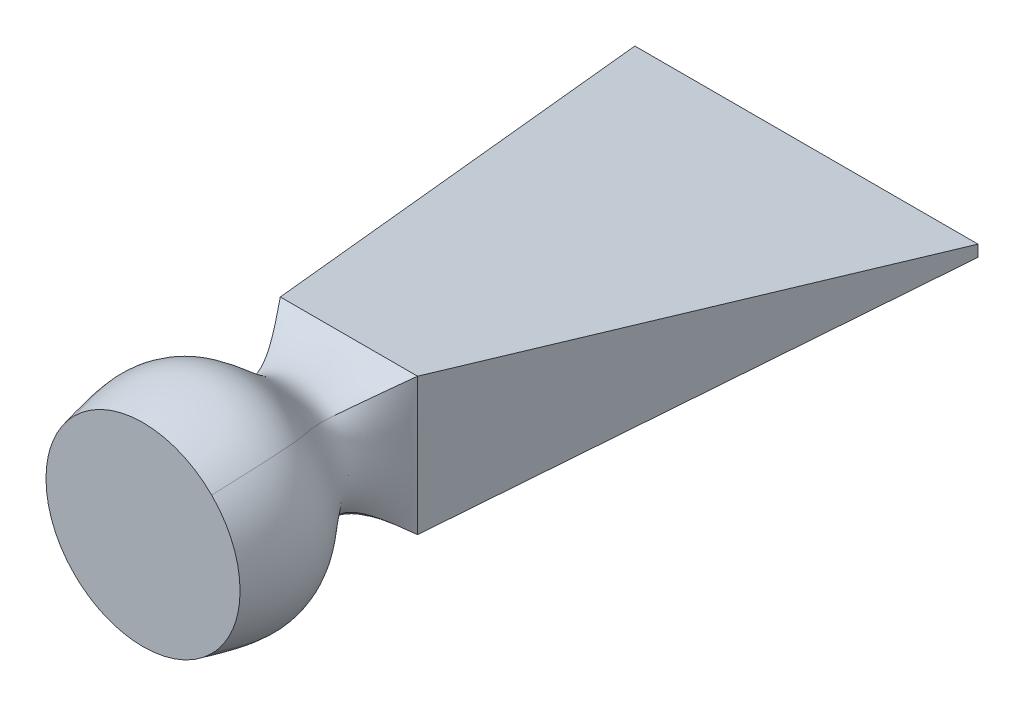
ISO-10303-21;
HEADER;
FILE_DESCRIPTION(('STEP AP214'),'2;1');
FILE_NAME('part.step','',(''),(''),'','','');
FILE_SCHEMA(('AUTOMOTIVE_DESIGN { 1 0 10303 214 1 1 1 1 }'));
ENDSEC;
DATA;
#1=APPLICATION_CONTEXT('core data for automotive mechanical design processes');
#2=APPLICATION_PROTOCOL_DEFINITION('international standard','automotive_design',2000,#1);
#3=PRODUCT_CONTEXT('',#1,'mechanical');
#4=PRODUCT('Part','Part','',(#3));
#5=PRODUCT_RELATED_PRODUCT_CATEGORY('part','',(#4));
#6=PRODUCT_DEFINITION_FORMATION('','',#4);
#7=PRODUCT_DEFINITION_CONTEXT('part definition',#1,'design');
#8=PRODUCT_DEFINITION('design','',#6,#7);
#9=PRODUCT_DEFINITION_SHAPE('','',#8);
#10=(LENGTH_UNIT() NAMED_UNIT(*) SI_UNIT(.MILLI.,.METRE.));
#11=(NAMED_UNIT(*) PLANE_ANGLE_UNIT() SI_UNIT($,.RADIAN.));
#12=(NAMED_UNIT(*) SI_UNIT($,.STERADIAN.) SOLID_ANGLE_UNIT());
#13=UNCERTAINTY_MEASURE_WITH_UNIT(LENGTH_MEASURE(1.E-05),#10,'distance_accuracy_value','');
#14=(GEOMETRIC_REPRESENTATION_CONTEXT(3) GLOBAL_UNCERTAINTY_ASSIGNED_CONTEXT((#13)) GLOBAL_UNIT_ASSIGNED_CONTEXT((#10,
#11,#12)) REPRESENTATION_CONTEXT('',''));
#15=CARTESIAN_POINT('',(0.,0.,0.));
#16=DIRECTION('',(0.,0.,1.));
#17=DIRECTION('',(1.,0.,0.));
#18=AXIS2_PLACEMENT_3D('',#15,#16,#17);
#19=CARTESIAN_POINT('',(0.,0.,90.));
#20=DIRECTION('',(0.,0.,1.));
#21=DIRECTION('',(1.,0.,0.));
#22=AXIS2_PLACEMENT_3D('',#19,#20,#21);
#23=PLANE('',#22);
#24=CARTESIAN_POINT('',(0.,0.,90.));
#25=DIRECTION('',(0.,0.,-1.));
#26=DIRECTION('',(1.,0.,0.));
#27=AXIS2_PLACEMENT_3D('',#24,#25,#26);
#28=CIRCLE('',#27,42.4264068711928);
#29=CARTESIAN_POINT('',(-30.,30.,90.));
#30=VERTEX_POINT('',#29);
#31=CARTESIAN_POINT('',(30.,30.,90.));
#32=VERTEX_POINT('',#31);
#33=EDGE_CURVE('E126',#30,#32,#28,.T.);
#34=ORIENTED_EDGE('',*,*,#33,.F.);
#35=CARTESIAN_POINT('',(-30.,-30.,90.));
#36=CARTESIAN_POINT('',(-46.557450297693,-13.442549702307,90.));
#37=CARTESIAN_POINT('',(-46.557450297693,13.442549702307,90.));
#38=CARTESIAN_POINT('',(-30.,30.,90.));
#39=B_SPLINE_CURVE_WITH_KNOTS('',3,(#35,#36,#37,#38),.UNSPECIFIED.,.F.,.F.,(4,4),(0.,1.),.UNSPECIFIED.);
#40=CARTESIAN_POINT('',(-30.,-30.,90.));
#41=VERTEX_POINT('',#40);
#42=EDGE_CURVE('E83',#41,#30,#39,.T.);
#43=ORIENTED_EDGE('',*,*,#42,.F.);
#44=CARTESIAN_POINT('',(30.,-30.,90.));
#45=CARTESIAN_POINT('',(13.442549702307,-46.557450297693,90.));
#46=CARTESIAN_POINT('',(-13.442549702307,-46.557450297693,90.));
#47=CARTESIAN_POINT('',(-30.,-30.,90.));
#48=B_SPLINE_CURVE_WITH_KNOTS('',3,(#44,#45,#46,#47),.UNSPECIFIED.,.F.,.F.,(4,4),(0.,1.),.UNSPECIFIED.);
#49=CARTESIAN_POINT('',(30.,-30.,90.));
#50=VERTEX_POINT('',#49);
#51=EDGE_CURVE('E72',#50,#41,#48,.T.);
#52=ORIENTED_EDGE('',*,*,#51,.F.);
#53=CARTESIAN_POINT('',(30.,30.,90.));
#54=CARTESIAN_POINT('',(46.557450297693,13.442549702307,90.));
#55=CARTESIAN_POINT('',(46.557450297693,-13.442549702307,90.));
#56=CARTESIAN_POINT('',(30.,-30.,90.));
#57=B_SPLINE_CURVE_WITH_KNOTS('',3,(#53,#54,#55,#56),.UNSPECIFIED.,.F.,.F.,(4,4),(0.,1.),.UNSPECIFIED.);
#58=EDGE_CURVE('E14',#32,#50,#57,.T.);
#59=ORIENTED_EDGE('',*,*,#58,.F.);
#60=EDGE_LOOP('',(#34,#43,#52,#59));
#61=FACE_BOUND('',#60,.T.);
#62=ADVANCED_FACE('F49',(#61),#23,.T.);
#63=CARTESIAN_POINT('',(-30.,-30.,90.));
#64=CARTESIAN_POINT('',(-32.1746109172198,-32.8272915726261,75.8698753625472));
#65=CARTESIAN_POINT('',(-36.0079546999678,-37.8111627038345,50.9616837409921));
#66=CARTESIAN_POINT('',(-8.05613485580845,-12.6956326424046,26.5121664833694));
#67=CARTESIAN_POINT('',(-22.8877493135882,-24.391462132661,8.59288794524507));
#68=CARTESIAN_POINT('',(-30.,-30.,0.));
#69=CARTESIAN_POINT('',(-46.557450297693,-13.442549702307,90.));
#70=CARTESIAN_POINT('',(-49.6782204145392,-14.9419255911291,75.8698753625472));
#71=CARTESIAN_POINT('',(-55.1794273799181,-17.584983802557,50.9616837409921));
#72=CARTESIAN_POINT('',(-19.8606450247527,-9.246826038816,26.5121664833694));
#73=CARTESIAN_POINT('',(-26.7137223133381,-9.75588794466155,8.59288794524507));
#74=CARTESIAN_POINT('',(-30.,-10.,0.));
#75=CARTESIAN_POINT('',(-46.557450297693,13.442549702307,90.));
#76=CARTESIAN_POINT('',(-49.9706768195403,13.9290206853176,75.8698753625472));
#77=CARTESIAN_POINT('',(-55.9874178204373,14.7865582353428,50.9616837409921));
#78=CARTESIAN_POINT('',(-21.9395343444214,2.04671978529237,26.5121664833694));
#79=CARTESIAN_POINT('',(-27.3875134569508,7.42225345012876,8.59288794524507));
#80=CARTESIAN_POINT('',(-30.,10.,0.));
#81=CARTESIAN_POINT('',(-30.,30.,90.));
#82=CARTESIAN_POINT('',(-32.8272915726261,32.1746109172198,75.8698753625472));
#83=CARTESIAN_POINT('',(-37.8111627038345,36.0079546999678,50.9616837409921));
#84=CARTESIAN_POINT('',(-12.6956326424046,8.05613485580843,26.5121664833694));
#85=CARTESIAN_POINT('',(-24.391462132661,22.8877493135882,8.59288794524507));
#86=CARTESIAN_POINT('',(-30.,30.,0.));
#87=B_SPLINE_SURFACE_WITH_KNOTS('',3,3,((#63,#64,#65,#66,#67,#68),(#69,#70,#71,#72,#73,#74),
(#75,#76,#77,#78,#79,#80),(#81,#82,#83,#84,#85,#86)),.UNSPECIFIED.,.F.,.F.,.F.,(4,4),(4,1,1,4),
(0.,1.),(0.,0.405588369270386,0.714959922892933,1.),.UNSPECIFIED.);
#88=CARTESIAN_POINT('',(-30.,30.,90.));
#89=CARTESIAN_POINT('',(-32.8272915726261,32.1746109172198,75.8698753625472));
#90=CARTESIAN_POINT('',(-37.8111627038345,36.0079546999678,50.9616837409921));
#91=CARTESIAN_POINT('',(-12.6956326424046,8.05613485580843,26.5121664833694));
#92=CARTESIAN_POINT('',(-24.391462132661,22.8877493135882,8.59288794524507));
#93=CARTESIAN_POINT('',(-30.,30.,0.));
#94=B_SPLINE_CURVE_WITH_KNOTS('',3,(#88,#89,#90,#91,#92,#93),.UNSPECIFIED.,.F.,.F.,(4,1,1,4),
(0.,0.405588369270386,0.714959922892933,1.),.UNSPECIFIED.);
#95=CARTESIAN_POINT('',(-30.,30.,0.));
#96=VERTEX_POINT('',#95);
#97=EDGE_CURVE('E56',#30,#96,#94,.T.);
#98=DIRECTION('',(0.,-1.,0.));
#99=VECTOR('',#98,1.);
#100=CARTESIAN_POINT('',(-30.,0.,0.));
#101=LINE('',#100,#99);
#102=CARTESIAN_POINT('',(-30.,-30.,0.));
#103=VERTEX_POINT('',#102);
#104=EDGE_CURVE('E108',#96,#103,#101,.T.);
#105=CARTESIAN_POINT('',(-30.,-30.,90.));
#106=CARTESIAN_POINT('',(-32.1746109172198,-32.8272915726261,75.8698753625472));
#107=CARTESIAN_POINT('',(-36.0079546999678,-37.8111627038345,50.9616837409921));
#108=CARTESIAN_POINT('',(-8.05613485580845,-12.6956326424046,26.5121664833694));
#109=CARTESIAN_POINT('',(-22.8877493135882,-24.391462132661,8.59288794524507));
#110=CARTESIAN_POINT('',(-30.,-30.,0.));
#111=B_SPLINE_CURVE_WITH_KNOTS('',3,(#105,#106,#107,#108,#109,#110),.UNSPECIFIED.,.F.,.F.,(4,1,
1,4),(0.,0.405588369270386,0.714959922892933,1.),.UNSPECIFIED.);
#112=EDGE_CURVE('E172',#41,#103,#111,.T.);
#113=ORIENTED_EDGE('',*,*,#42,.T.);
#114=ORIENTED_EDGE('',*,*,#97,.T.);
#115=ORIENTED_EDGE('',*,*,#104,.T.);
#116=ORIENTED_EDGE('',*,*,#112,.F.);
#117=EDGE_LOOP('',(#113,#114,#115,#116));
#118=FACE_BOUND('',#117,.T.);
#119=ADVANCED_FACE('F129',(#118),#87,.T.);
#120=CARTESIAN_POINT('',(-30.,30.,90.));
#121=CARTESIAN_POINT('',(-32.8272915726261,32.1746109172198,75.8698753625472));
#122=CARTESIAN_POINT('',(-37.8111627038345,36.0079546999678,50.9616837409921));
#123=CARTESIAN_POINT('',(-12.6956326424046,8.05613485580842,26.5121664833694));
#124=CARTESIAN_POINT('',(-24.391462132661,22.8877493135882,8.59288794524507));
#125=CARTESIAN_POINT('',(-30.,30.,0.));
#126=CARTESIAN_POINT('',(-13.4425497023069,46.557450297693,90.));
#127=CARTESIAN_POINT('',(-14.9419255911291,49.6782204145392,75.8698753625472));
#128=CARTESIAN_POINT('',(-17.5849838025571,55.1794273799181,50.9616837409921));
#129=CARTESIAN_POINT('',(-9.24682603881604,19.8606450247526,26.5121664833694));
#130=CARTESIAN_POINT('',(-9.75588794466156,26.7137223133381,8.59288794524507));
#131=CARTESIAN_POINT('',(-10.,30.,0.));
#132=CARTESIAN_POINT('',(13.442549702307,46.557450297693,90.));
#133=CARTESIAN_POINT('',(13.9290206853175,49.9706768195403,75.8698753625472));
#134=CARTESIAN_POINT('',(14.7865582353427,55.9874178204373,50.9616837409921));
#135=CARTESIAN_POINT('',(2.04671978529227,21.9395343444214,26.5121664833694));
#136=CARTESIAN_POINT('',(7.42225345012873,27.3875134569508,8.59288794524507));
#137=CARTESIAN_POINT('',(10.,30.,0.));
#138=CARTESIAN_POINT('',(30.,30.,90.));
#139=CARTESIAN_POINT('',(32.1746109172197,32.8272915726261,75.8698753625472));
#140=CARTESIAN_POINT('',(36.0079546999677,37.8111627038346,50.9616837409921));
#141=CARTESIAN_POINT('',(8.05613485580836,12.6956326424047,26.5121664833694));
#142=CARTESIAN_POINT('',(22.8877493135882,24.391462132661,8.59288794524507));
#143=CARTESIAN_POINT('',(30.,30.,0.));
#144=B_SPLINE_SURFACE_WITH_KNOTS('',3,3,((#120,#121,#122,#123,#124,#125),(#126,#127,#128,#129,
#130,#131),(#132,#133,#134,#135,#136,#137),(#138,#139,#140,#141,#142,#143)),.UNSPECIFIED.,.F.,
.F.,.F.,(4,4),(4,1,1,4),(0.,1.),(0.,0.405588369270386,0.714959922892933,1.),.UNSPECIFIED.);
#145=CARTESIAN_POINT('',(30.,30.,90.));
#146=CARTESIAN_POINT('',(32.1746109172197,32.8272915726261,75.8698753625472));
#147=CARTESIAN_POINT('',(36.0079546999678,37.8111627038346,50.9616837409921));
#148=CARTESIAN_POINT('',(8.05613485580837,12.6956326424047,26.5121664833694));
#149=CARTESIAN_POINT('',(22.8877493135882,24.391462132661,8.59288794524507));
#150=CARTESIAN_POINT('',(30.,30.,0.));
#151=B_SPLINE_CURVE_WITH_KNOTS('',3,(#145,#146,#147,#148,#149,#150),.UNSPECIFIED.,.F.,.F.,(4,1,
1,4),(0.,0.405588369270386,0.714959922892933,1.),.UNSPECIFIED.);
#152=CARTESIAN_POINT('',(30.,30.,0.));
#153=VERTEX_POINT('',#152);
#154=EDGE_CURVE('E124',#153,#32,#151,.F.);
#155=DIRECTION('',(-1.,0.,0.));
#156=VECTOR('',#155,1.);
#157=CARTESIAN_POINT('',(0.,30.,0.));
#158=LINE('',#157,#156);
#159=EDGE_CURVE('E96',#153,#96,#158,.T.);
#160=ORIENTED_EDGE('',*,*,#33,.T.);
#161=ORIENTED_EDGE('',*,*,#154,.F.);
#162=ORIENTED_EDGE('',*,*,#159,.T.);
#163=ORIENTED_EDGE('',*,*,#97,.F.);
#164=EDGE_LOOP('',(#160,#161,#162,#163));
#165=FACE_BOUND('',#164,.T.);
#166=ADVANCED_FACE('F121',(#165),#144,.T.);
#167=CARTESIAN_POINT('',(30.,-30.,90.));
#168=CARTESIAN_POINT('',(32.8272915726261,-32.1746109172197,75.8698753625472));
#169=CARTESIAN_POINT('',(37.8111627038345,-36.0079546999678,50.9616837409921));
#170=CARTESIAN_POINT('',(12.6956326424046,-8.05613485580846,26.5121664833694));
#171=CARTESIAN_POINT('',(24.391462132661,-22.8877493135882,8.59288794524507));
#172=CARTESIAN_POINT('',(30.,-30.,0.));
#173=CARTESIAN_POINT('',(13.442549702307,-46.557450297693,90.));
#174=CARTESIAN_POINT('',(14.9419255911291,-49.6782204145392,75.8698753625472));
#175=CARTESIAN_POINT('',(17.5849838025571,-55.1794273799181,50.9616837409921));
#176=CARTESIAN_POINT('',(9.24682603881599,-19.8606450247527,26.5121664833694));
#177=CARTESIAN_POINT('',(9.75588794466155,-26.7137223133381,8.59288794524507));
#178=CARTESIAN_POINT('',(10.,-30.,0.));
#179=CARTESIAN_POINT('',(-13.442549702307,-46.557450297693,90.));
#180=CARTESIAN_POINT('',(-13.9290206853176,-49.9706768195403,75.8698753625472));
#181=CARTESIAN_POINT('',(-14.7865582353429,-55.9874178204373,50.9616837409921));
#182=CARTESIAN_POINT('',(-2.0467197852924,-21.9395343444214,26.5121664833694));
#183=CARTESIAN_POINT('',(-7.42225345012877,-27.3875134569508,8.59288794524507));
#184=CARTESIAN_POINT('',(-9.99999999999999,-30.,0.));
#185=CARTESIAN_POINT('',(-30.,-30.,90.));
#186=CARTESIAN_POINT('',(-32.1746109172198,-32.8272915726261,75.8698753625472));
#187=CARTESIAN_POINT('',(-36.0079546999678,-37.8111627038345,50.9616837409921));
#188=CARTESIAN_POINT('',(-8.05613485580845,-12.6956326424046,26.5121664833694));
#189=CARTESIAN_POINT('',(-22.8877493135882,-24.391462132661,8.59288794524507));
#190=CARTESIAN_POINT('',(-30.,-30.,0.));
#191=B_SPLINE_SURFACE_WITH_KNOTS('',3,3,((#167,#168,#169,#170,#171,#172),(#173,#174,#175,#176,
#177,#178),(#179,#180,#181,#182,#183,#184),(#185,#186,#187,#188,#189,#190)),.UNSPECIFIED.,.F.,
.F.,.F.,(4,4),(4,1,1,4),(0.,1.),(0.,0.405588369270386,0.714959922892933,1.),.UNSPECIFIED.);
#192=DIRECTION('',(1.,0.,0.));
#193=VECTOR('',#192,1.);
#194=CARTESIAN_POINT('',(0.,-30.,0.));
#195=LINE('',#194,#193);
#196=CARTESIAN_POINT('',(30.,-30.,0.));
#197=VERTEX_POINT('',#196);
#198=EDGE_CURVE('E218',#103,#197,#195,.T.);
#199=CARTESIAN_POINT('',(30.,-30.,90.));
#200=CARTESIAN_POINT('',(32.8272915726261,-32.1746109172197,75.8698753625472));
#201=CARTESIAN_POINT('',(37.8111627038345,-36.0079546999678,50.9616837409921));
#202=CARTESIAN_POINT('',(12.6956326424046,-8.05613485580846,26.5121664833694));
#203=CARTESIAN_POINT('',(24.391462132661,-22.8877493135882,8.59288794524507));
#204=CARTESIAN_POINT('',(30.,-30.,0.));
#205=B_SPLINE_CURVE_WITH_KNOTS('',3,(#199,#200,#201,#202,#203,#204),.UNSPECIFIED.,.F.,.F.,(4,1,
1,4),(0.,0.405588369270386,0.714959922892933,1.),.UNSPECIFIED.);
#206=EDGE_CURVE('E63',#50,#197,#205,.T.);
#207=ORIENTED_EDGE('',*,*,#51,.T.);
#208=ORIENTED_EDGE('',*,*,#112,.T.);
#209=ORIENTED_EDGE('',*,*,#198,.T.);
#210=ORIENTED_EDGE('',*,*,#206,.F.);
#211=EDGE_LOOP('',(#207,#208,#209,#210));
#212=FACE_BOUND('',#211,.T.);
#213=ADVANCED_FACE('F177',(#212),#191,.T.);
#214=CARTESIAN_POINT('',(30.,30.,90.));
#215=CARTESIAN_POINT('',(32.1746109172197,32.8272915726261,75.8698753625472));
#216=CARTESIAN_POINT('',(36.0079546999678,37.8111627038346,50.9616837409921));
#217=CARTESIAN_POINT('',(8.05613485580837,12.6956326424047,26.5121664833694));
#218=CARTESIAN_POINT('',(22.8877493135882,24.391462132661,8.59288794524507));
#219=CARTESIAN_POINT('',(30.,30.,0.));
#220=CARTESIAN_POINT('',(46.557450297693,13.442549702307,90.));
#221=CARTESIAN_POINT('',(49.6782204145392,14.9419255911291,75.8698753625472));
#222=CARTESIAN_POINT('',(55.1794273799181,17.5849838025571,50.9616837409921));
#223=CARTESIAN_POINT('',(19.8606450247526,9.24682603881611,26.5121664833694));
#224=CARTESIAN_POINT('',(26.713722313338,9.75588794466159,8.59288794524507));
#225=CARTESIAN_POINT('',(30.,10.,0.));
#226=CARTESIAN_POINT('',(46.557450297693,-13.442549702307,90.));
#227=CARTESIAN_POINT('',(49.9706768195403,-13.9290206853176,75.8698753625472));
#228=CARTESIAN_POINT('',(55.9874178204373,-14.7865582353428,50.9616837409921));
#229=CARTESIAN_POINT('',(21.9395343444214,-2.04671978529241,26.5121664833694));
#230=CARTESIAN_POINT('',(27.3875134569508,-7.42225345012877,8.59288794524507));
#231=CARTESIAN_POINT('',(30.,-10.,0.));
#232=CARTESIAN_POINT('',(30.,-30.,90.));
#233=CARTESIAN_POINT('',(32.8272915726261,-32.1746109172197,75.8698753625472));
#234=CARTESIAN_POINT('',(37.8111627038345,-36.0079546999678,50.9616837409921));
#235=CARTESIAN_POINT('',(12.6956326424046,-8.05613485580846,26.5121664833694));
#236=CARTESIAN_POINT('',(24.391462132661,-22.8877493135882,8.59288794524507));
#237=CARTESIAN_POINT('',(30.,-30.,0.));
#238=B_SPLINE_SURFACE_WITH_KNOTS('',3,3,((#214,#215,#216,#217,#218,#219),(#220,#221,#222,#223,
#224,#225),(#226,#227,#228,#229,#230,#231),(#232,#233,#234,#235,#236,#237)),.UNSPECIFIED.,.F.,
.F.,.F.,(4,4),(4,1,1,4),(0.,1.),(0.,0.405588369270386,0.714959922892933,1.),.UNSPECIFIED.);
#239=DIRECTION('',(0.,1.,0.));
#240=VECTOR('',#239,1.);
#241=CARTESIAN_POINT('',(30.,0.,0.));
#242=LINE('',#241,#240);
#243=EDGE_CURVE('E223',#197,#153,#242,.T.);
#244=ORIENTED_EDGE('',*,*,#58,.T.);
#245=ORIENTED_EDGE('',*,*,#206,.T.);
#246=ORIENTED_EDGE('',*,*,#243,.T.);
#247=ORIENTED_EDGE('',*,*,#154,.T.);
#248=EDGE_LOOP('',(#244,#245,#246,#247));
#249=FACE_BOUND('',#248,.T.);
#250=ADVANCED_FACE('F51',(#249),#238,.T.);
#251=CARTESIAN_POINT('',(-75.,2.5,-200.));
#252=DIRECTION('',(0.,0.,1.));
#253=DIRECTION('',(1.,0.,0.));
#254=AXIS2_PLACEMENT_3D('',#251,#252,#253);
#255=PLANE('',#254);
#256=DIRECTION('',(0.,-1.,0.));
#257=VECTOR('',#256,1.);
#258=CARTESIAN_POINT('',(-75.,2.5,-200.));
#259=LINE('',#258,#257);
#260=CARTESIAN_POINT('',(-75.,2.5,-200.));
#261=VERTEX_POINT('',#260);
#262=CARTESIAN_POINT('',(-75.,-2.5,-200.));
#263=VERTEX_POINT('',#262);
#264=EDGE_CURVE('E273',#261,#263,#259,.T.);
#265=ORIENTED_EDGE('',*,*,#264,.F.);
#266=DIRECTION('',(-1.,0.,0.));
#267=VECTOR('',#266,1.);
#268=CARTESIAN_POINT('',(-75.,2.5,-200.));
#269=LINE('',#268,#267);
#270=CARTESIAN_POINT('',(75.,2.5,-200.));
#271=VERTEX_POINT('',#270);
#272=EDGE_CURVE('E100',#271,#261,#269,.T.);
#273=ORIENTED_EDGE('',*,*,#272,.F.);
#274=DIRECTION('',(0.,1.,0.));
#275=VECTOR('',#274,1.);
#276=CARTESIAN_POINT('',(75.,2.5,-200.));
#277=LINE('',#276,#275);
#278=CARTESIAN_POINT('',(75.,-2.5,-200.));
#279=VERTEX_POINT('',#278);
#280=EDGE_CURVE('E268',#279,#271,#277,.T.);
#281=ORIENTED_EDGE('',*,*,#280,.F.);
#282=DIRECTION('',(1.,0.,0.));
#283=VECTOR('',#282,1.);
#284=CARTESIAN_POINT('',(-75.,-2.5,-200.));
#285=LINE('',#284,#283);
#286=EDGE_CURVE('E271',#263,#279,#285,.T.);
#287=ORIENTED_EDGE('',*,*,#286,.F.);
#288=EDGE_LOOP('',(#265,#273,#281,#287));
#289=FACE_BOUND('',#288,.T.);
#290=ADVANCED_FACE('F337',(#289),#255,.F.);
#291=CARTESIAN_POINT('',(30.,-30.,0.));
#292=DIRECTION('',(0.975609756097561,0.,0.219512195121951));
#293=DIRECTION('',(0.219512195121951,0.,-0.975609756097561));
#294=AXIS2_PLACEMENT_3D('',#291,#292,#293);
#295=PLANE('',#294);
#296=DIRECTION('',(0.217563370783763,0.132955393256744,-0.966948314594504));
#297=VECTOR('',#296,1.);
#298=CARTESIAN_POINT('',(30.,-30.,0.));
#299=LINE('',#298,#297);
#300=EDGE_CURVE('E285',#197,#279,#299,.T.);
#301=ORIENTED_EDGE('',*,*,#300,.T.);
#302=ORIENTED_EDGE('',*,*,#280,.T.);
#303=DIRECTION('',(0.217563370783763,-0.132955393256744,-0.966948314594504));
#304=VECTOR('',#303,1.);
#305=CARTESIAN_POINT('',(30.,30.,0.));
#306=LINE('',#305,#304);
#307=EDGE_CURVE('E275',#153,#271,#306,.T.);
#308=ORIENTED_EDGE('',*,*,#307,.F.);
#309=ORIENTED_EDGE('',*,*,#243,.F.);
#310=EDGE_LOOP('',(#301,#302,#308,#309));
#311=FACE_BOUND('',#310,.T.);
#312=ADVANCED_FACE('F292',(#311),#295,.T.);
#313=CARTESIAN_POINT('',(75.,2.5,-200.));
#314=DIRECTION('',(0.,0.990678839845296,-0.136218340478728));
#315=DIRECTION('',(0.,0.136218340478728,0.990678839845296));
#316=AXIS2_PLACEMENT_3D('',#313,#314,#315);
#317=PLANE('',#316);
#318=ORIENTED_EDGE('',*,*,#307,.T.);
#319=ORIENTED_EDGE('',*,*,#272,.T.);
#320=DIRECTION('',(-0.217563370783763,-0.132955393256744,-0.966948314594504));
#321=VECTOR('',#320,1.);
#322=CARTESIAN_POINT('',(-30.,30.,0.));
#323=LINE('',#322,#321);
#324=EDGE_CURVE('E90',#96,#261,#323,.T.);
#325=ORIENTED_EDGE('',*,*,#324,.F.);
#326=ORIENTED_EDGE('',*,*,#159,.F.);
#327=EDGE_LOOP('',(#318,#319,#325,#326));
#328=FACE_BOUND('',#327,.T.);
#329=ADVANCED_FACE('F93',(#328),#317,.T.);
#330=CARTESIAN_POINT('',(-75.,-2.5,-200.));
#331=DIRECTION('',(0.,-0.990678839845296,-0.136218340478728));
#332=DIRECTION('',(0.,0.136218340478728,-0.990678839845296));
#333=AXIS2_PLACEMENT_3D('',#330,#331,#332);
#334=PLANE('',#333);
#335=DIRECTION('',(-0.217563370783763,0.132955393256744,-0.966948314594504));
#336=VECTOR('',#335,1.);
#337=CARTESIAN_POINT('',(-30.,-30.,0.));
#338=LINE('',#337,#336);
#339=EDGE_CURVE('E104',#103,#263,#338,.T.);
#340=ORIENTED_EDGE('',*,*,#339,.T.);
#341=ORIENTED_EDGE('',*,*,#286,.T.);
#342=ORIENTED_EDGE('',*,*,#300,.F.);
#343=ORIENTED_EDGE('',*,*,#198,.F.);
#344=EDGE_LOOP('',(#340,#341,#342,#343));
#345=FACE_BOUND('',#344,.T.);
#346=ADVANCED_FACE('F282',(#345),#334,.T.);
#347=CARTESIAN_POINT('',(-75.,2.5,-200.));
#348=DIRECTION('',(-0.975609756097561,0.,0.219512195121951));
#349=DIRECTION('',(0.219512195121951,0.,0.975609756097561));
#350=AXIS2_PLACEMENT_3D('',#347,#348,#349);
#351=PLANE('',#350);
#352=ORIENTED_EDGE('',*,*,#324,.T.);
#353=ORIENTED_EDGE('',*,*,#264,.T.);
#354=ORIENTED_EDGE('',*,*,#339,.F.);
#355=ORIENTED_EDGE('',*,*,#104,.F.);
#356=EDGE_LOOP('',(#352,#353,#354,#355));
#357=FACE_BOUND('',#356,.T.);
#358=ADVANCED_FACE('F109',(#357),#351,.T.);
#359=CLOSED_SHELL('',(#62,#119,#166,#213,#250,#290,#312,#329,#346,#358));
#360=MANIFOLD_SOLID_BREP('B2',#359);
#361=ADVANCED_BREP_SHAPE_REPRESENTATION('',(#18,#360),#14);
#362=SHAPE_DEFINITION_REPRESENTATION(#9,#361);
ENDSEC;
END-ISO-10303-21;
